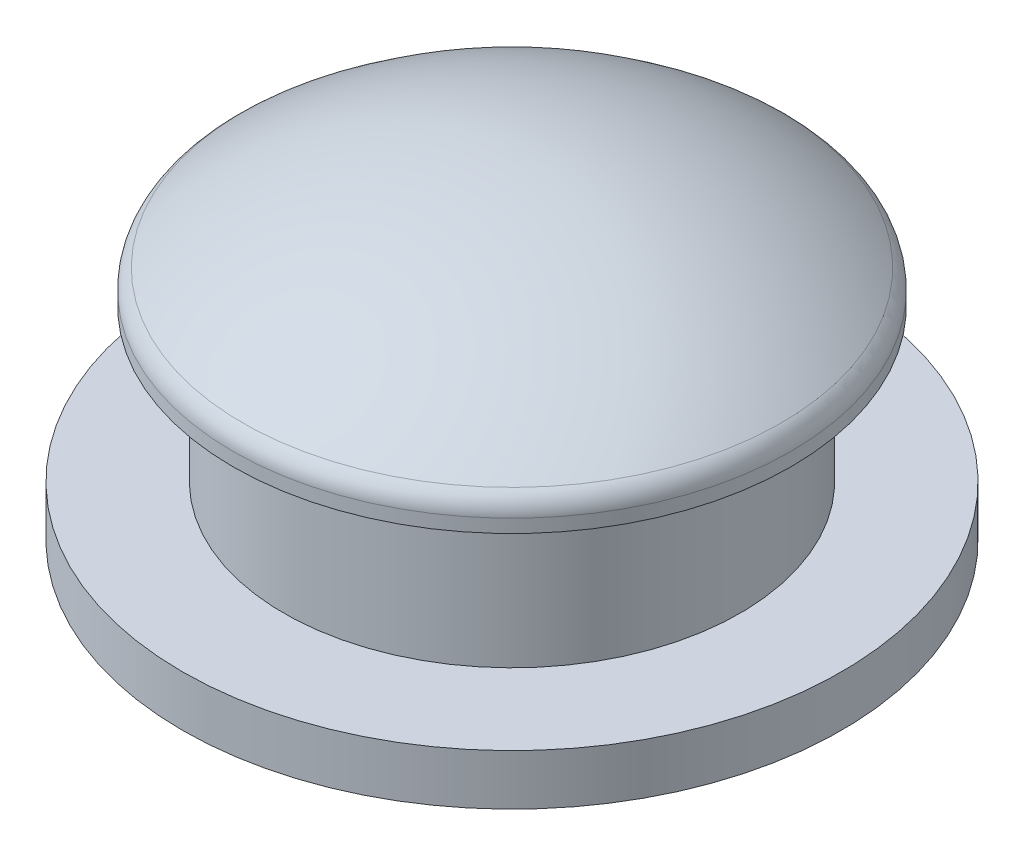
ISO-10303-21;
HEADER;
FILE_DESCRIPTION(('STEP AP214'),'2;1');
FILE_NAME('part.step','',(''),(''),'','','');
FILE_SCHEMA(('AUTOMOTIVE_DESIGN { 1 0 10303 214 1 1 1 1 }'));
ENDSEC;
DATA;
#1=APPLICATION_CONTEXT('core data for automotive mechanical design processes');
#2=APPLICATION_PROTOCOL_DEFINITION('international standard','automotive_design',2000,#1);
#3=PRODUCT_CONTEXT('',#1,'mechanical');
#4=PRODUCT('Part','Part','',(#3));
#5=PRODUCT_RELATED_PRODUCT_CATEGORY('part','',(#4));
#6=PRODUCT_DEFINITION_FORMATION('','',#4);
#7=PRODUCT_DEFINITION_CONTEXT('part definition',#1,'design');
#8=PRODUCT_DEFINITION('design','',#6,#7);
#9=PRODUCT_DEFINITION_SHAPE('','',#8);
#10=(LENGTH_UNIT() NAMED_UNIT(*) SI_UNIT(.MILLI.,.METRE.));
#11=(NAMED_UNIT(*) PLANE_ANGLE_UNIT() SI_UNIT($,.RADIAN.));
#12=(NAMED_UNIT(*) SI_UNIT($,.STERADIAN.) SOLID_ANGLE_UNIT());
#13=UNCERTAINTY_MEASURE_WITH_UNIT(LENGTH_MEASURE(1.E-05),#10,'distance_accuracy_value','');
#14=(GEOMETRIC_REPRESENTATION_CONTEXT(3) GLOBAL_UNCERTAINTY_ASSIGNED_CONTEXT((#13)) GLOBAL_UNIT_ASSIGNED_CONTEXT((#10,
#11,#12)) REPRESENTATION_CONTEXT('',''));
#15=CARTESIAN_POINT('',(0.,0.,0.));
#16=DIRECTION('',(0.,0.,1.));
#17=DIRECTION('',(1.,0.,0.));
#18=AXIS2_PLACEMENT_3D('',#15,#16,#17);
#19=CARTESIAN_POINT('',(6.5,0.,0.));
#20=DIRECTION('',(0.,-1.,0.));
#21=DIRECTION('',(0.,0.,-1.));
#22=AXIS2_PLACEMENT_3D('',#19,#20,#21);
#23=PLANE('',#22);
#24=CARTESIAN_POINT('',(0.,0.,0.));
#25=DIRECTION('',(0.,-1.,0.));
#26=DIRECTION('',(0.,0.,-1.));
#27=AXIS2_PLACEMENT_3D('',#24,#25,#26);
#28=CIRCLE('',#27,5.5);
#29=CARTESIAN_POINT('',(0.,0.,-5.5));
#30=VERTEX_POINT('',#29);
#31=EDGE_CURVE('E10',#30,#30,#28,.F.);
#32=ORIENTED_EDGE('',*,*,#31,.T.);
#33=EDGE_LOOP('',(#32));
#34=FACE_BOUND('',#33,.T.);
#35=CARTESIAN_POINT('',(0.,0.,0.));
#36=DIRECTION('',(0.,-1.,0.));
#37=DIRECTION('',(0.,0.,-1.));
#38=AXIS2_PLACEMENT_3D('',#35,#36,#37);
#39=CIRCLE('',#38,6.5);
#40=CARTESIAN_POINT('',(0.,0.,-6.5));
#41=VERTEX_POINT('',#40);
#42=EDGE_CURVE('E62',#41,#41,#39,.T.);
#43=ORIENTED_EDGE('',*,*,#42,.T.);
#44=EDGE_LOOP('',(#43));
#45=FACE_BOUND('',#44,.T.);
#46=ADVANCED_FACE('F30',(#34,#45),#23,.T.);
#47=CARTESIAN_POINT('',(0.,-2.0625,0.));
#48=DIRECTION('',(0.,0.,1.));
#49=DIRECTION('',(1.,0.,0.));
#50=AXIS2_PLACEMENT_3D('',#47,#48,#49);
#51=SPHERICAL_SURFACE('',#50,8.5625);
#52=CARTESIAN_POINT('',(0.,-2.0625,0.));
#53=DIRECTION('',(0.,-1.,0.));
#54=DIRECTION('',(0.,0.,-1.));
#55=AXIS2_PLACEMENT_3D('',#52,#53,#54);
#56=SPHERICAL_SURFACE('',#55,8.5625);
#57=CARTESIAN_POINT('',(0.,4.65460376488087,0.));
#58=DIRECTION('',(0.,-1.,0.));
#59=DIRECTION('',(0.,0.,-1.));
#60=AXIS2_PLACEMENT_3D('',#57,#58,#59);
#61=CIRCLE('',#60,5.31007751937984);
#62=CARTESIAN_POINT('',(0.,4.65460376488087,-5.31007751937984));
#63=VERTEX_POINT('',#62);
#64=EDGE_CURVE('E41',#63,#63,#61,.F.);
#65=ORIENTED_EDGE('',*,*,#64,.T.);
#66=EDGE_LOOP('',(#65));
#67=FACE_BOUND('',#66,.T.);
#68=ADVANCED_FACE('F84',(#67),#56,.T.);
#69=CARTESIAN_POINT('',(0.,0.,0.));
#70=DIRECTION('',(0.,-1.,0.));
#71=DIRECTION('',(0.,0.,-1.));
#72=AXIS2_PLACEMENT_3D('',#69,#70,#71);
#73=CYLINDRICAL_SURFACE('',#72,5.5);
#74=CARTESIAN_POINT('',(0.,4.26236412897542,0.));
#75=DIRECTION('',(0.,-1.,0.));
#76=DIRECTION('',(0.,0.,-1.));
#77=AXIS2_PLACEMENT_3D('',#74,#75,#76);
#78=CIRCLE('',#77,5.5);
#79=CARTESIAN_POINT('',(0.,4.26236412897542,-5.5));
#80=VERTEX_POINT('',#79);
#81=EDGE_CURVE('E45',#80,#80,#78,.T.);
#82=ORIENTED_EDGE('',*,*,#81,.T.);
#83=EDGE_LOOP('',(#82));
#84=FACE_BOUND('',#83,.T.);
#85=CARTESIAN_POINT('',(0.,4.,0.));
#86=DIRECTION('',(0.,-1.,0.));
#87=DIRECTION('',(0.,0.,-1.));
#88=AXIS2_PLACEMENT_3D('',#85,#86,#87);
#89=CIRCLE('',#88,5.5);
#90=CARTESIAN_POINT('',(0.,4.,-5.5));
#91=VERTEX_POINT('',#90);
#92=EDGE_CURVE('E50',#91,#91,#89,.T.);
#93=ORIENTED_EDGE('',*,*,#92,.F.);
#94=EDGE_LOOP('',(#93));
#95=FACE_BOUND('',#94,.T.);
#96=ADVANCED_FACE('F89',(#84,#95),#73,.T.);
#97=CARTESIAN_POINT('',(5.5,4.,0.));
#98=DIRECTION('',(0.,-1.,0.));
#99=DIRECTION('',(0.,0.,-1.));
#100=AXIS2_PLACEMENT_3D('',#97,#98,#99);
#101=PLANE('',#100);
#102=ORIENTED_EDGE('',*,*,#92,.T.);
#103=EDGE_LOOP('',(#102));
#104=FACE_BOUND('',#103,.T.);
#105=CARTESIAN_POINT('',(0.,4.,0.));
#106=DIRECTION('',(0.,-1.,0.));
#107=DIRECTION('',(0.,0.,-1.));
#108=AXIS2_PLACEMENT_3D('',#105,#106,#107);
#109=CIRCLE('',#108,4.5);
#110=CARTESIAN_POINT('',(0.,4.,-4.5));
#111=VERTEX_POINT('',#110);
#112=EDGE_CURVE('E53',#111,#111,#109,.T.);
#113=ORIENTED_EDGE('',*,*,#112,.F.);
#114=EDGE_LOOP('',(#113));
#115=FACE_BOUND('',#114,.T.);
#116=ADVANCED_FACE('F96',(#104,#115),#101,.T.);
#117=CARTESIAN_POINT('',(0.,0.,0.));
#118=DIRECTION('',(0.,-1.,0.));
#119=DIRECTION('',(0.,0.,-1.));
#120=AXIS2_PLACEMENT_3D('',#117,#118,#119);
#121=CYLINDRICAL_SURFACE('',#120,4.5);
#122=ORIENTED_EDGE('',*,*,#112,.T.);
#123=EDGE_LOOP('',(#122));
#124=FACE_BOUND('',#123,.T.);
#125=CARTESIAN_POINT('',(0.,1.,0.));
#126=DIRECTION('',(0.,-1.,0.));
#127=DIRECTION('',(0.,0.,-1.));
#128=AXIS2_PLACEMENT_3D('',#125,#126,#127);
#129=CIRCLE('',#128,4.5);
#130=CARTESIAN_POINT('',(0.,1.,-4.5));
#131=VERTEX_POINT('',#130);
#132=EDGE_CURVE('E56',#131,#131,#129,.T.);
#133=ORIENTED_EDGE('',*,*,#132,.F.);
#134=EDGE_LOOP('',(#133));
#135=FACE_BOUND('',#134,.T.);
#136=ADVANCED_FACE('F100',(#124,#135),#121,.T.);
#137=CARTESIAN_POINT('',(4.5,1.,0.));
#138=DIRECTION('',(0.,1.,0.));
#139=DIRECTION('',(0.,0.,1.));
#140=AXIS2_PLACEMENT_3D('',#137,#138,#139);
#141=PLANE('',#140);
#142=ORIENTED_EDGE('',*,*,#132,.T.);
#143=EDGE_LOOP('',(#142));
#144=FACE_BOUND('',#143,.T.);
#145=CARTESIAN_POINT('',(0.,1.,0.));
#146=DIRECTION('',(0.,-1.,0.));
#147=DIRECTION('',(0.,0.,-1.));
#148=AXIS2_PLACEMENT_3D('',#145,#146,#147);
#149=CIRCLE('',#148,6.5);
#150=CARTESIAN_POINT('',(0.,1.,-6.5));
#151=VERTEX_POINT('',#150);
#152=EDGE_CURVE('E59',#151,#151,#149,.T.);
#153=ORIENTED_EDGE('',*,*,#152,.F.);
#154=EDGE_LOOP('',(#153));
#155=FACE_BOUND('',#154,.T.);
#156=ADVANCED_FACE('F104',(#144,#155),#141,.T.);
#157=CARTESIAN_POINT('',(0.,0.,0.));
#158=DIRECTION('',(0.,-1.,0.));
#159=DIRECTION('',(0.,0.,-1.));
#160=AXIS2_PLACEMENT_3D('',#157,#158,#159);
#161=CYLINDRICAL_SURFACE('',#160,6.5);
#162=ORIENTED_EDGE('',*,*,#152,.T.);
#163=EDGE_LOOP('',(#162));
#164=FACE_BOUND('',#163,.T.);
#165=ORIENTED_EDGE('',*,*,#42,.F.);
#166=EDGE_LOOP('',(#165));
#167=FACE_BOUND('',#166,.T.);
#168=ADVANCED_FACE('F80',(#164,#167),#161,.T.);
#169=CARTESIAN_POINT('',(0.,4.26236412897542,0.));
#170=DIRECTION('',(0.,-1.,0.));
#171=DIRECTION('',(0.,0.,-1.));
#172=AXIS2_PLACEMENT_3D('',#169,#170,#171);
#173=TOROIDAL_SURFACE('',#172,5.,0.5);
#174=ORIENTED_EDGE('',*,*,#64,.F.);
#175=EDGE_LOOP('',(#174));
#176=FACE_BOUND('',#175,.T.);
#177=ORIENTED_EDGE('',*,*,#81,.F.);
#178=EDGE_LOOP('',(#177));
#179=FACE_BOUND('',#178,.T.);
#180=ADVANCED_FACE('F73',(#176,#179),#173,.T.);
#181=CARTESIAN_POINT('',(0.,0.,0.));
#182=DIRECTION('',(0.,-1.,0.));
#183=DIRECTION('',(0.,0.,-1.));
#184=AXIS2_PLACEMENT_3D('',#181,#182,#183);
#185=CYLINDRICAL_SURFACE('',#184,3.5);
#186=CARTESIAN_POINT('',(0.,2.,0.));
#187=DIRECTION('',(0.,-1.,0.));
#188=DIRECTION('',(0.,0.,-1.));
#189=AXIS2_PLACEMENT_3D('',#186,#187,#188);
#190=CIRCLE('',#189,3.5);
#191=CARTESIAN_POINT('',(0.,2.,-3.5));
#192=VERTEX_POINT('',#191);
#193=EDGE_CURVE('E37',#192,#192,#190,.T.);
#194=ORIENTED_EDGE('',*,*,#193,.T.);
#195=EDGE_LOOP('',(#194));
#196=FACE_BOUND('',#195,.T.);
#197=CARTESIAN_POINT('',(0.,4.64133518965077,0.));
#198=DIRECTION('',(0.,-1.,0.));
#199=DIRECTION('',(0.,0.,-1.));
#200=AXIS2_PLACEMENT_3D('',#197,#198,#199);
#201=CIRCLE('',#200,3.5);
#202=CARTESIAN_POINT('',(0.,4.64133518965077,-3.5));
#203=VERTEX_POINT('',#202);
#204=EDGE_CURVE('E65',#203,#203,#201,.T.);
#205=ORIENTED_EDGE('',*,*,#204,.F.);
#206=EDGE_LOOP('',(#205));
#207=FACE_BOUND('',#206,.T.);
#208=ADVANCED_FACE('F71',(#196,#207),#185,.F.);
#209=CARTESIAN_POINT('',(0.,-2.0625,0.));
#210=DIRECTION('',(0.,0.,1.));
#211=DIRECTION('',(1.,0.,0.));
#212=AXIS2_PLACEMENT_3D('',#209,#210,#211);
#213=SPHERICAL_SURFACE('',#212,7.5625);
#214=CARTESIAN_POINT('',(0.,-2.0625,0.));
#215=DIRECTION('',(0.,-1.,0.));
#216=DIRECTION('',(0.,0.,-1.));
#217=AXIS2_PLACEMENT_3D('',#214,#215,#216);
#218=SPHERICAL_SURFACE('',#217,7.5625);
#219=ORIENTED_EDGE('',*,*,#204,.T.);
#220=EDGE_LOOP('',(#219));
#221=FACE_BOUND('',#220,.T.);
#222=ADVANCED_FACE('F69',(#221),#218,.F.);
#223=CARTESIAN_POINT('',(0.,2.,0.));
#224=DIRECTION('',(0.,-1.,0.));
#225=DIRECTION('',(0.,0.,-1.));
#226=AXIS2_PLACEMENT_3D('',#223,#224,#225);
#227=TOROIDAL_SURFACE('',#226,5.5,2.);
#228=ORIENTED_EDGE('',*,*,#31,.F.);
#229=EDGE_LOOP('',(#228));
#230=FACE_BOUND('',#229,.T.);
#231=ORIENTED_EDGE('',*,*,#193,.F.);
#232=EDGE_LOOP('',(#231));
#233=FACE_BOUND('',#232,.T.);
#234=ADVANCED_FACE('F32',(#230,#233),#227,.T.);
#235=CLOSED_SHELL('',(#46,#68,#96,#116,#136,#156,#168,#180,#208,#222,#234));
#236=MANIFOLD_SOLID_BREP('B2',#235);
#237=ADVANCED_BREP_SHAPE_REPRESENTATION('',(#18,#236),#14);
#238=SHAPE_DEFINITION_REPRESENTATION(#9,#237);
ENDSEC;
END-ISO-10303-21;
